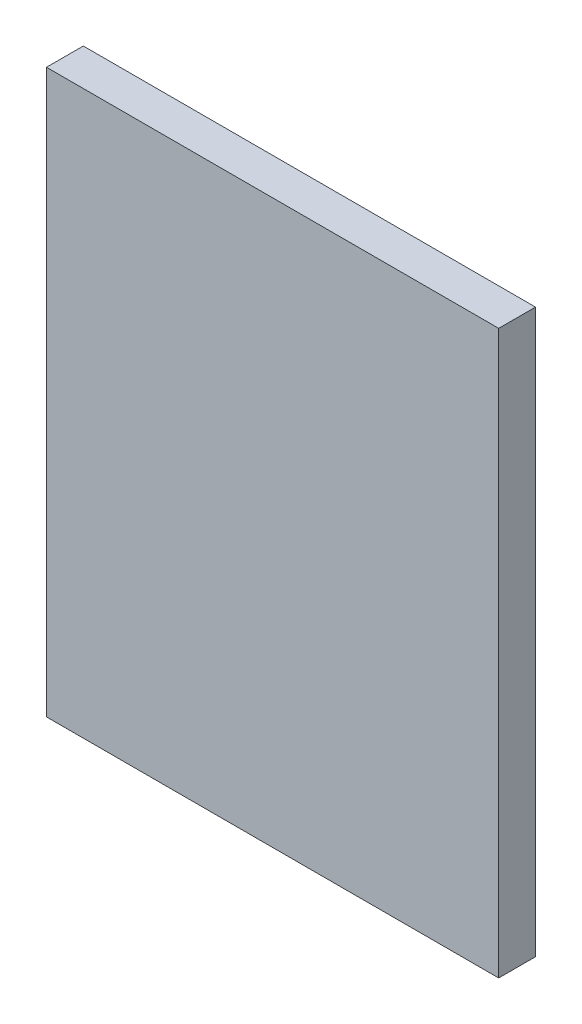
ISO-10303-21;
HEADER;
FILE_DESCRIPTION(('STEP AP214'),'2;1');
FILE_NAME('part.step','',(''),(''),'','','');
FILE_SCHEMA(('AUTOMOTIVE_DESIGN { 1 0 10303 214 1 1 1 1 }'));
ENDSEC;
DATA;
#1=APPLICATION_CONTEXT('core data for automotive mechanical design processes');
#2=APPLICATION_PROTOCOL_DEFINITION('international standard','automotive_design',2000,#1);
#3=PRODUCT_CONTEXT('',#1,'mechanical');
#4=PRODUCT('Part','Part','',(#3));
#5=PRODUCT_RELATED_PRODUCT_CATEGORY('part','',(#4));
#6=PRODUCT_DEFINITION_FORMATION('','',#4);
#7=PRODUCT_DEFINITION_CONTEXT('part definition',#1,'design');
#8=PRODUCT_DEFINITION('design','',#6,#7);
#9=PRODUCT_DEFINITION_SHAPE('','',#8);
#10=(LENGTH_UNIT() NAMED_UNIT(*) SI_UNIT(.MILLI.,.METRE.));
#11=(NAMED_UNIT(*) PLANE_ANGLE_UNIT() SI_UNIT($,.RADIAN.));
#12=(NAMED_UNIT(*) SI_UNIT($,.STERADIAN.) SOLID_ANGLE_UNIT());
#13=UNCERTAINTY_MEASURE_WITH_UNIT(LENGTH_MEASURE(1.E-05),#10,'distance_accuracy_value','');
#14=(GEOMETRIC_REPRESENTATION_CONTEXT(3) GLOBAL_UNCERTAINTY_ASSIGNED_CONTEXT((#13)) GLOBAL_UNIT_ASSIGNED_CONTEXT((#10,
#11,#12)) REPRESENTATION_CONTEXT('',''));
#15=CARTESIAN_POINT('',(0.,0.,0.));
#16=DIRECTION('',(0.,0.,1.));
#17=DIRECTION('',(1.,0.,0.));
#18=AXIS2_PLACEMENT_3D('',#15,#16,#17);
#19=CARTESIAN_POINT('',(-69.0100527436609,504.377099841521,35.));
#20=DIRECTION('',(1.,0.,0.));
#21=DIRECTION('',(0.,1.,0.));
#22=AXIS2_PLACEMENT_3D('',#19,#20,#21);
#23=PLANE('',#22);
#24=DIRECTION('',(0.,-1.,0.));
#25=VECTOR('',#24,1.);
#26=CARTESIAN_POINT('',(-69.0100527436609,504.377099841521,0.));
#27=LINE('',#26,#25);
#28=CARTESIAN_POINT('',(-69.0100527436609,504.377099841521,0.));
#29=VERTEX_POINT('',#28);
#30=CARTESIAN_POINT('',(-69.0100527436609,-30.6229001584786,0.));
#31=VERTEX_POINT('',#30);
#32=EDGE_CURVE('E96',#29,#31,#27,.T.);
#33=ORIENTED_EDGE('',*,*,#32,.T.);
#34=DIRECTION('',(0.,0.,-1.));
#35=VECTOR('',#34,1.);
#36=CARTESIAN_POINT('',(-69.0100527436609,-30.6229001584786,35.));
#37=LINE('',#36,#35);
#38=CARTESIAN_POINT('',(-69.0100527436609,-30.6229001584786,35.));
#39=VERTEX_POINT('',#38);
#40=EDGE_CURVE('E11',#39,#31,#37,.T.);
#41=ORIENTED_EDGE('',*,*,#40,.F.);
#42=DIRECTION('',(0.,-1.,0.));
#43=VECTOR('',#42,1.);
#44=CARTESIAN_POINT('',(-69.0100527436609,504.377099841521,35.));
#45=LINE('',#44,#43);
#46=CARTESIAN_POINT('',(-69.0100527436609,504.377099841521,35.));
#47=VERTEX_POINT('',#46);
#48=EDGE_CURVE('E84',#47,#39,#45,.T.);
#49=ORIENTED_EDGE('',*,*,#48,.F.);
#50=DIRECTION('',(0.,0.,-1.));
#51=VECTOR('',#50,1.);
#52=CARTESIAN_POINT('',(-69.0100527436609,504.377099841521,35.));
#53=LINE('',#52,#51);
#54=EDGE_CURVE('E92',#47,#29,#53,.T.);
#55=ORIENTED_EDGE('',*,*,#54,.T.);
#56=EDGE_LOOP('',(#33,#41,#49,#55));
#57=FACE_BOUND('',#56,.T.);
#58=ADVANCED_FACE('F33',(#57),#23,.F.);
#59=CARTESIAN_POINT('',(-69.0100527436609,-30.6229001584786,35.));
#60=DIRECTION('',(0.,1.,0.));
#61=DIRECTION('',(0.,0.,1.));
#62=AXIS2_PLACEMENT_3D('',#59,#60,#61);
#63=PLANE('',#62);
#64=DIRECTION('',(1.,0.,0.));
#65=VECTOR('',#64,1.);
#66=CARTESIAN_POINT('',(-69.0100527436609,-30.6229001584786,0.));
#67=LINE('',#66,#65);
#68=CARTESIAN_POINT('',(360.989947256339,-30.6229001584786,0.));
#69=VERTEX_POINT('',#68);
#70=EDGE_CURVE('E88',#31,#69,#67,.T.);
#71=ORIENTED_EDGE('',*,*,#70,.T.);
#72=DIRECTION('',(0.,0.,-1.));
#73=VECTOR('',#72,1.);
#74=CARTESIAN_POINT('',(360.989947256339,-30.6229001584786,35.));
#75=LINE('',#74,#73);
#76=CARTESIAN_POINT('',(360.989947256339,-30.6229001584786,35.));
#77=VERTEX_POINT('',#76);
#78=EDGE_CURVE('E41',#77,#69,#75,.T.);
#79=ORIENTED_EDGE('',*,*,#78,.F.);
#80=DIRECTION('',(1.,0.,0.));
#81=VECTOR('',#80,1.);
#82=CARTESIAN_POINT('',(-69.0100527436609,-30.6229001584786,35.));
#83=LINE('',#82,#81);
#84=EDGE_CURVE('E79',#39,#77,#83,.T.);
#85=ORIENTED_EDGE('',*,*,#84,.F.);
#86=ORIENTED_EDGE('',*,*,#40,.T.);
#87=EDGE_LOOP('',(#71,#79,#85,#86));
#88=FACE_BOUND('',#87,.T.);
#89=ADVANCED_FACE('F87',(#88),#63,.F.);
#90=CARTESIAN_POINT('',(360.989947256339,504.377099841521,35.));
#91=DIRECTION('',(-1.,0.,0.));
#92=DIRECTION('',(0.,-1.,0.));
#93=AXIS2_PLACEMENT_3D('',#90,#91,#92);
#94=PLANE('',#93);
#95=DIRECTION('',(0.,1.,0.));
#96=VECTOR('',#95,1.);
#97=CARTESIAN_POINT('',(360.989947256339,504.377099841521,0.));
#98=LINE('',#97,#96);
#99=CARTESIAN_POINT('',(360.989947256339,504.377099841521,0.));
#100=VERTEX_POINT('',#99);
#101=EDGE_CURVE('E66',#69,#100,#98,.T.);
#102=ORIENTED_EDGE('',*,*,#101,.T.);
#103=DIRECTION('',(0.,0.,-1.));
#104=VECTOR('',#103,1.);
#105=CARTESIAN_POINT('',(360.989947256339,504.377099841521,35.));
#106=LINE('',#105,#104);
#107=CARTESIAN_POINT('',(360.989947256339,504.377099841521,35.));
#108=VERTEX_POINT('',#107);
#109=EDGE_CURVE('E89',#108,#100,#106,.T.);
#110=ORIENTED_EDGE('',*,*,#109,.F.);
#111=DIRECTION('',(0.,1.,0.));
#112=VECTOR('',#111,1.);
#113=CARTESIAN_POINT('',(360.989947256339,504.377099841521,35.));
#114=LINE('',#113,#112);
#115=EDGE_CURVE('E82',#77,#108,#114,.T.);
#116=ORIENTED_EDGE('',*,*,#115,.F.);
#117=ORIENTED_EDGE('',*,*,#78,.T.);
#118=EDGE_LOOP('',(#102,#110,#116,#117));
#119=FACE_BOUND('',#118,.T.);
#120=ADVANCED_FACE('F90',(#119),#94,.F.);
#121=CARTESIAN_POINT('',(-69.0100527436609,504.377099841521,35.));
#122=DIRECTION('',(0.,-1.,0.));
#123=DIRECTION('',(0.,0.,-1.));
#124=AXIS2_PLACEMENT_3D('',#121,#122,#123);
#125=PLANE('',#124);
#126=DIRECTION('',(-1.,0.,0.));
#127=VECTOR('',#126,1.);
#128=CARTESIAN_POINT('',(-69.0100527436609,504.377099841521,0.));
#129=LINE('',#128,#127);
#130=EDGE_CURVE('E72',#100,#29,#129,.T.);
#131=ORIENTED_EDGE('',*,*,#130,.T.);
#132=ORIENTED_EDGE('',*,*,#54,.F.);
#133=DIRECTION('',(-1.,0.,0.));
#134=VECTOR('',#133,1.);
#135=CARTESIAN_POINT('',(-69.0100527436609,504.377099841521,35.));
#136=LINE('',#135,#134);
#137=EDGE_CURVE('E49',#108,#47,#136,.T.);
#138=ORIENTED_EDGE('',*,*,#137,.F.);
#139=ORIENTED_EDGE('',*,*,#109,.T.);
#140=EDGE_LOOP('',(#131,#132,#138,#139));
#141=FACE_BOUND('',#140,.T.);
#142=ADVANCED_FACE('F103',(#141),#125,.F.);
#143=CARTESIAN_POINT('',(0.,0.,35.));
#144=DIRECTION('',(0.,0.,1.));
#145=DIRECTION('',(1.,0.,0.));
#146=AXIS2_PLACEMENT_3D('',#143,#144,#145);
#147=PLANE('',#146);
#148=ORIENTED_EDGE('',*,*,#48,.T.);
#149=ORIENTED_EDGE('',*,*,#84,.T.);
#150=ORIENTED_EDGE('',*,*,#115,.T.);
#151=ORIENTED_EDGE('',*,*,#137,.T.);
#152=EDGE_LOOP('',(#148,#149,#150,#151));
#153=FACE_BOUND('',#152,.T.);
#154=ADVANCED_FACE('F80',(#153),#147,.T.);
#155=CARTESIAN_POINT('',(0.,0.,0.));
#156=DIRECTION('',(0.,0.,1.));
#157=DIRECTION('',(1.,0.,0.));
#158=AXIS2_PLACEMENT_3D('',#155,#156,#157);
#159=PLANE('',#158);
#160=ORIENTED_EDGE('',*,*,#32,.F.);
#161=ORIENTED_EDGE('',*,*,#130,.F.);
#162=ORIENTED_EDGE('',*,*,#101,.F.);
#163=ORIENTED_EDGE('',*,*,#70,.F.);
#164=EDGE_LOOP('',(#160,#161,#162,#163));
#165=FACE_BOUND('',#164,.T.);
#166=ADVANCED_FACE('F106',(#165),#159,.F.);
#167=CLOSED_SHELL('',(#58,#89,#120,#142,#154,#166));
#168=MANIFOLD_SOLID_BREP('B2',#167);
#169=ADVANCED_BREP_SHAPE_REPRESENTATION('',(#18,#168),#14);
#170=SHAPE_DEFINITION_REPRESENTATION(#9,#169);
ENDSEC;
END-ISO-10303-21;
